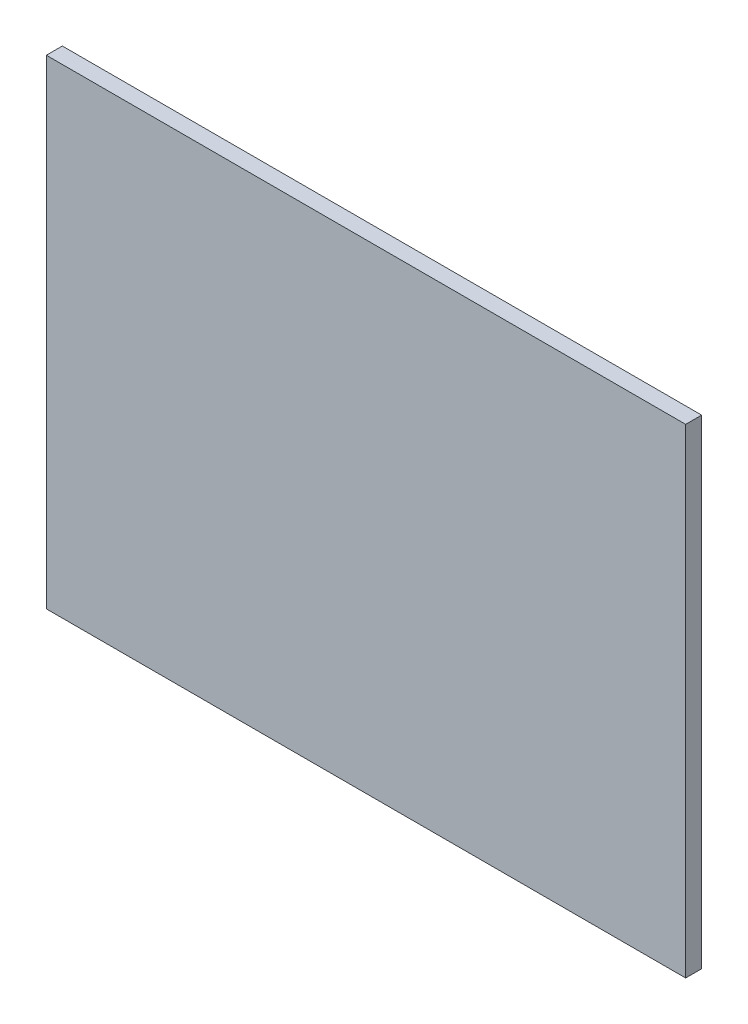
ISO-10303-21;
HEADER;
FILE_DESCRIPTION(('STEP AP214'),'2;1');
FILE_NAME('part.step','',(''),(''),'','','');
FILE_SCHEMA(('AUTOMOTIVE_DESIGN { 1 0 10303 214 1 1 1 1 }'));
ENDSEC;
DATA;
#1=APPLICATION_CONTEXT('core data for automotive mechanical design processes');
#2=APPLICATION_PROTOCOL_DEFINITION('international standard','automotive_design',2000,#1);
#3=PRODUCT_CONTEXT('',#1,'mechanical');
#4=PRODUCT('Part','Part','',(#3));
#5=PRODUCT_RELATED_PRODUCT_CATEGORY('part','',(#4));
#6=PRODUCT_DEFINITION_FORMATION('','',#4);
#7=PRODUCT_DEFINITION_CONTEXT('part definition',#1,'design');
#8=PRODUCT_DEFINITION('design','',#6,#7);
#9=PRODUCT_DEFINITION_SHAPE('','',#8);
#10=(LENGTH_UNIT() NAMED_UNIT(*) SI_UNIT(.MILLI.,.METRE.));
#11=(NAMED_UNIT(*) PLANE_ANGLE_UNIT() SI_UNIT($,.RADIAN.));
#12=(NAMED_UNIT(*) SI_UNIT($,.STERADIAN.) SOLID_ANGLE_UNIT());
#13=UNCERTAINTY_MEASURE_WITH_UNIT(LENGTH_MEASURE(1.E-05),#10,'distance_accuracy_value','');
#14=(GEOMETRIC_REPRESENTATION_CONTEXT(3) GLOBAL_UNCERTAINTY_ASSIGNED_CONTEXT((#13)) GLOBAL_UNIT_ASSIGNED_CONTEXT((#10,
#11,#12)) REPRESENTATION_CONTEXT('',''));
#15=CARTESIAN_POINT('',(0.,0.,0.));
#16=DIRECTION('',(0.,0.,1.));
#17=DIRECTION('',(1.,0.,0.));
#18=AXIS2_PLACEMENT_3D('',#15,#16,#17);
#19=CARTESIAN_POINT('',(-30.,-22.5,1.5));
#20=DIRECTION('',(1.,0.,0.));
#21=DIRECTION('',(0.,0.,-1.));
#22=AXIS2_PLACEMENT_3D('',#19,#20,#21);
#23=PLANE('',#22);
#24=DIRECTION('',(0.,-1.,0.));
#25=VECTOR('',#24,1.);
#26=CARTESIAN_POINT('',(-30.,-22.5,0.));
#27=LINE('',#26,#25);
#28=CARTESIAN_POINT('',(-30.,22.5,0.));
#29=VERTEX_POINT('',#28);
#30=CARTESIAN_POINT('',(-30.,-22.5,0.));
#31=VERTEX_POINT('',#30);
#32=EDGE_CURVE('E96',#29,#31,#27,.T.);
#33=ORIENTED_EDGE('',*,*,#32,.T.);
#34=DIRECTION('',(0.,0.,-1.));
#35=VECTOR('',#34,1.);
#36=CARTESIAN_POINT('',(-30.,-22.5,1.5));
#37=LINE('',#36,#35);
#38=CARTESIAN_POINT('',(-30.,-22.5,1.5));
#39=VERTEX_POINT('',#38);
#40=EDGE_CURVE('E11',#39,#31,#37,.T.);
#41=ORIENTED_EDGE('',*,*,#40,.F.);
#42=DIRECTION('',(0.,-1.,0.));
#43=VECTOR('',#42,1.);
#44=CARTESIAN_POINT('',(-30.,-22.5,1.5));
#45=LINE('',#44,#43);
#46=CARTESIAN_POINT('',(-30.,22.5,1.5));
#47=VERTEX_POINT('',#46);
#48=EDGE_CURVE('E84',#47,#39,#45,.T.);
#49=ORIENTED_EDGE('',*,*,#48,.F.);
#50=DIRECTION('',(0.,0.,-1.));
#51=VECTOR('',#50,1.);
#52=CARTESIAN_POINT('',(-30.,22.5,1.5));
#53=LINE('',#52,#51);
#54=EDGE_CURVE('E92',#47,#29,#53,.T.);
#55=ORIENTED_EDGE('',*,*,#54,.T.);
#56=EDGE_LOOP('',(#33,#41,#49,#55));
#57=FACE_BOUND('',#56,.T.);
#58=ADVANCED_FACE('F33',(#57),#23,.F.);
#59=CARTESIAN_POINT('',(30.,-22.5,1.5));
#60=DIRECTION('',(0.,1.,0.));
#61=DIRECTION('',(-1.,0.,0.));
#62=AXIS2_PLACEMENT_3D('',#59,#60,#61);
#63=PLANE('',#62);
#64=DIRECTION('',(1.,0.,0.));
#65=VECTOR('',#64,1.);
#66=CARTESIAN_POINT('',(30.,-22.5,0.));
#67=LINE('',#66,#65);
#68=CARTESIAN_POINT('',(30.,-22.5,0.));
#69=VERTEX_POINT('',#68);
#70=EDGE_CURVE('E88',#31,#69,#67,.T.);
#71=ORIENTED_EDGE('',*,*,#70,.T.);
#72=DIRECTION('',(0.,0.,-1.));
#73=VECTOR('',#72,1.);
#74=CARTESIAN_POINT('',(30.,-22.5,1.5));
#75=LINE('',#74,#73);
#76=CARTESIAN_POINT('',(30.,-22.5,1.5));
#77=VERTEX_POINT('',#76);
#78=EDGE_CURVE('E41',#77,#69,#75,.T.);
#79=ORIENTED_EDGE('',*,*,#78,.F.);
#80=DIRECTION('',(1.,0.,0.));
#81=VECTOR('',#80,1.);
#82=CARTESIAN_POINT('',(30.,-22.5,1.5));
#83=LINE('',#82,#81);
#84=EDGE_CURVE('E79',#39,#77,#83,.T.);
#85=ORIENTED_EDGE('',*,*,#84,.F.);
#86=ORIENTED_EDGE('',*,*,#40,.T.);
#87=EDGE_LOOP('',(#71,#79,#85,#86));
#88=FACE_BOUND('',#87,.T.);
#89=ADVANCED_FACE('F87',(#88),#63,.F.);
#90=CARTESIAN_POINT('',(30.,-22.5,1.5));
#91=DIRECTION('',(-1.,0.,0.));
#92=DIRECTION('',(0.,0.,1.));
#93=AXIS2_PLACEMENT_3D('',#90,#91,#92);
#94=PLANE('',#93);
#95=DIRECTION('',(0.,1.,0.));
#96=VECTOR('',#95,1.);
#97=CARTESIAN_POINT('',(30.,-22.5,0.));
#98=LINE('',#97,#96);
#99=CARTESIAN_POINT('',(30.,22.5,0.));
#100=VERTEX_POINT('',#99);
#101=EDGE_CURVE('E66',#69,#100,#98,.T.);
#102=ORIENTED_EDGE('',*,*,#101,.T.);
#103=DIRECTION('',(0.,0.,-1.));
#104=VECTOR('',#103,1.);
#105=CARTESIAN_POINT('',(30.,22.5,1.5));
#106=LINE('',#105,#104);
#107=CARTESIAN_POINT('',(30.,22.5,1.5));
#108=VERTEX_POINT('',#107);
#109=EDGE_CURVE('E89',#108,#100,#106,.T.);
#110=ORIENTED_EDGE('',*,*,#109,.F.);
#111=DIRECTION('',(0.,1.,0.));
#112=VECTOR('',#111,1.);
#113=CARTESIAN_POINT('',(30.,-22.5,1.5));
#114=LINE('',#113,#112);
#115=EDGE_CURVE('E82',#77,#108,#114,.T.);
#116=ORIENTED_EDGE('',*,*,#115,.F.);
#117=ORIENTED_EDGE('',*,*,#78,.T.);
#118=EDGE_LOOP('',(#102,#110,#116,#117));
#119=FACE_BOUND('',#118,.T.);
#120=ADVANCED_FACE('F90',(#119),#94,.F.);
#121=CARTESIAN_POINT('',(30.,22.5,1.5));
#122=DIRECTION('',(0.,-1.,0.));
#123=DIRECTION('',(1.,0.,0.));
#124=AXIS2_PLACEMENT_3D('',#121,#122,#123);
#125=PLANE('',#124);
#126=DIRECTION('',(-1.,0.,0.));
#127=VECTOR('',#126,1.);
#128=CARTESIAN_POINT('',(30.,22.5,0.));
#129=LINE('',#128,#127);
#130=EDGE_CURVE('E72',#100,#29,#129,.T.);
#131=ORIENTED_EDGE('',*,*,#130,.T.);
#132=ORIENTED_EDGE('',*,*,#54,.F.);
#133=DIRECTION('',(-1.,0.,0.));
#134=VECTOR('',#133,1.);
#135=CARTESIAN_POINT('',(30.,22.5,1.5));
#136=LINE('',#135,#134);
#137=EDGE_CURVE('E49',#108,#47,#136,.T.);
#138=ORIENTED_EDGE('',*,*,#137,.F.);
#139=ORIENTED_EDGE('',*,*,#109,.T.);
#140=EDGE_LOOP('',(#131,#132,#138,#139));
#141=FACE_BOUND('',#140,.T.);
#142=ADVANCED_FACE('F103',(#141),#125,.F.);
#143=CARTESIAN_POINT('',(0.,0.,1.5));
#144=DIRECTION('',(0.,0.,1.));
#145=DIRECTION('',(1.,0.,0.));
#146=AXIS2_PLACEMENT_3D('',#143,#144,#145);
#147=PLANE('',#146);
#148=ORIENTED_EDGE('',*,*,#48,.T.);
#149=ORIENTED_EDGE('',*,*,#84,.T.);
#150=ORIENTED_EDGE('',*,*,#115,.T.);
#151=ORIENTED_EDGE('',*,*,#137,.T.);
#152=EDGE_LOOP('',(#148,#149,#150,#151));
#153=FACE_BOUND('',#152,.T.);
#154=ADVANCED_FACE('F80',(#153),#147,.T.);
#155=CARTESIAN_POINT('',(0.,0.,0.));
#156=DIRECTION('',(0.,0.,1.));
#157=DIRECTION('',(1.,0.,0.));
#158=AXIS2_PLACEMENT_3D('',#155,#156,#157);
#159=PLANE('',#158);
#160=ORIENTED_EDGE('',*,*,#32,.F.);
#161=ORIENTED_EDGE('',*,*,#130,.F.);
#162=ORIENTED_EDGE('',*,*,#101,.F.);
#163=ORIENTED_EDGE('',*,*,#70,.F.);
#164=EDGE_LOOP('',(#160,#161,#162,#163));
#165=FACE_BOUND('',#164,.T.);
#166=ADVANCED_FACE('F106',(#165),#159,.F.);
#167=CLOSED_SHELL('',(#58,#89,#120,#142,#154,#166));
#168=MANIFOLD_SOLID_BREP('B2',#167);
#169=ADVANCED_BREP_SHAPE_REPRESENTATION('',(#18,#168),#14);
#170=SHAPE_DEFINITION_REPRESENTATION(#9,#169);
ENDSEC;
END-ISO-10303-21;
